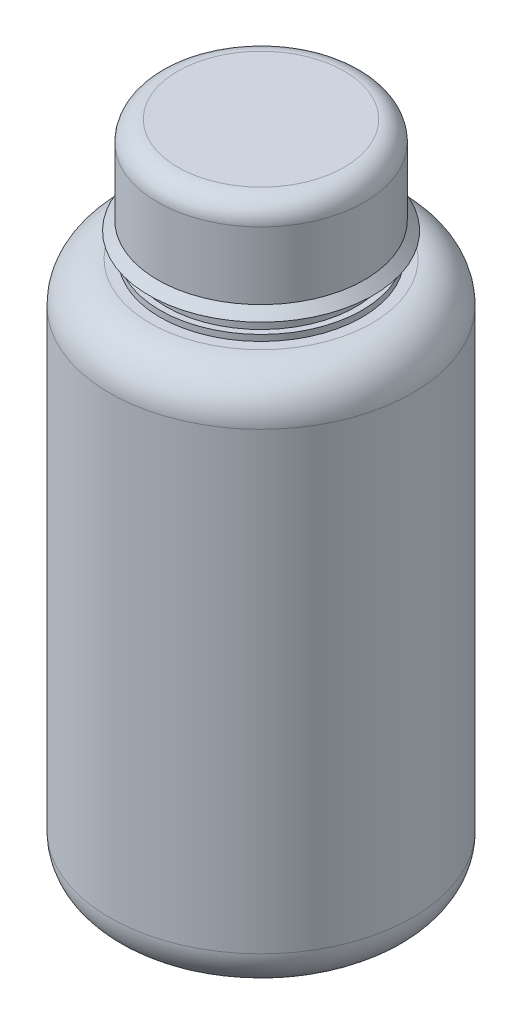
ISO-10303-21;
HEADER;
FILE_DESCRIPTION(('STEP AP214'),'2;1');
FILE_NAME('part.step','',(''),(''),'','','');
FILE_SCHEMA(('AUTOMOTIVE_DESIGN { 1 0 10303 214 1 1 1 1 }'));
ENDSEC;
DATA;
#1=APPLICATION_CONTEXT('core data for automotive mechanical design processes');
#2=APPLICATION_PROTOCOL_DEFINITION('international standard','automotive_design',2000,#1);
#3=PRODUCT_CONTEXT('',#1,'mechanical');
#4=PRODUCT('Part','Part','',(#3));
#5=PRODUCT_RELATED_PRODUCT_CATEGORY('part','',(#4));
#6=PRODUCT_DEFINITION_FORMATION('','',#4);
#7=PRODUCT_DEFINITION_CONTEXT('part definition',#1,'design');
#8=PRODUCT_DEFINITION('design','',#6,#7);
#9=PRODUCT_DEFINITION_SHAPE('','',#8);
#10=(LENGTH_UNIT() NAMED_UNIT(*) SI_UNIT(.MILLI.,.METRE.));
#11=(NAMED_UNIT(*) PLANE_ANGLE_UNIT() SI_UNIT($,.RADIAN.));
#12=(NAMED_UNIT(*) SI_UNIT($,.STERADIAN.) SOLID_ANGLE_UNIT());
#13=UNCERTAINTY_MEASURE_WITH_UNIT(LENGTH_MEASURE(1.E-05),#10,'distance_accuracy_value','');
#14=(GEOMETRIC_REPRESENTATION_CONTEXT(3) GLOBAL_UNCERTAINTY_ASSIGNED_CONTEXT((#13)) GLOBAL_UNIT_ASSIGNED_CONTEXT((#10,
#11,#12)) REPRESENTATION_CONTEXT('',''));
#15=CARTESIAN_POINT('',(0.,0.,0.));
#16=DIRECTION('',(0.,0.,1.));
#17=DIRECTION('',(1.,0.,0.));
#18=AXIS2_PLACEMENT_3D('',#15,#16,#17);
#19=CARTESIAN_POINT('',(0.,0.,0.));
#20=DIRECTION('',(0.,1.,0.));
#21=DIRECTION('',(0.,0.,1.));
#22=AXIS2_PLACEMENT_3D('',#19,#20,#21);
#23=PLANE('',#22);
#24=CARTESIAN_POINT('',(0.,0.,0.));
#25=DIRECTION('',(0.,-1.,0.));
#26=DIRECTION('',(0.,0.,-1.));
#27=AXIS2_PLACEMENT_3D('',#24,#25,#26);
#28=CIRCLE('',#27,34.9249999999999);
#29=CARTESIAN_POINT('',(0.,0.,-34.9249999999999));
#30=VERTEX_POINT('',#29);
#31=EDGE_CURVE('E10',#30,#30,#28,.T.);
#32=ORIENTED_EDGE('',*,*,#31,.T.);
#33=EDGE_LOOP('',(#32));
#34=FACE_BOUND('',#33,.T.);
#35=ADVANCED_FACE('F33',(#34),#23,.F.);
#36=CARTESIAN_POINT('',(0.,12.7,0.));
#37=DIRECTION('',(0.,-1.,0.));
#38=DIRECTION('',(0.,0.,-1.));
#39=AXIS2_PLACEMENT_3D('',#36,#37,#38);
#40=TOROIDAL_SURFACE('',#39,34.925,12.7);
#41=ORIENTED_EDGE('',*,*,#31,.F.);
#42=EDGE_LOOP('',(#41));
#43=FACE_BOUND('',#42,.T.);
#44=CARTESIAN_POINT('',(0.,12.7,0.));
#45=DIRECTION('',(0.,-1.,0.));
#46=DIRECTION('',(0.,0.,-1.));
#47=AXIS2_PLACEMENT_3D('',#44,#45,#46);
#48=CIRCLE('',#47,47.625);
#49=CARTESIAN_POINT('',(0.,12.7,-47.625));
#50=VERTEX_POINT('',#49);
#51=EDGE_CURVE('E39',#50,#50,#48,.T.);
#52=ORIENTED_EDGE('',*,*,#51,.T.);
#53=EDGE_LOOP('',(#52));
#54=FACE_BOUND('',#53,.T.);
#55=ADVANCED_FACE('F95',(#43,#54),#40,.T.);
#56=CARTESIAN_POINT('',(0.,-30.5346889952153,0.));
#57=DIRECTION('',(0.,-1.,0.));
#58=DIRECTION('',(0.,0.,-1.));
#59=AXIS2_PLACEMENT_3D('',#56,#57,#58);
#60=CYLINDRICAL_SURFACE('',#59,47.625);
#61=ORIENTED_EDGE('',*,*,#51,.F.);
#62=EDGE_LOOP('',(#61));
#63=FACE_BOUND('',#62,.T.);
#64=CARTESIAN_POINT('',(0.,155.575,0.));
#65=DIRECTION('',(0.,-1.,0.));
#66=DIRECTION('',(0.,0.,-1.));
#67=AXIS2_PLACEMENT_3D('',#64,#65,#66);
#68=CIRCLE('',#67,47.625);
#69=CARTESIAN_POINT('',(0.,155.575,-47.625));
#70=VERTEX_POINT('',#69);
#71=EDGE_CURVE('E43',#70,#70,#68,.T.);
#72=ORIENTED_EDGE('',*,*,#71,.T.);
#73=EDGE_LOOP('',(#72));
#74=FACE_BOUND('',#73,.T.);
#75=ADVANCED_FACE('F99',(#63,#74),#60,.T.);
#76=CARTESIAN_POINT('',(0.,155.575,0.));
#77=DIRECTION('',(0.,-1.,0.));
#78=DIRECTION('',(0.,0.,-1.));
#79=AXIS2_PLACEMENT_3D('',#76,#77,#78);
#80=TOROIDAL_SURFACE('',#79,34.925,12.7);
#81=ORIENTED_EDGE('',*,*,#71,.F.);
#82=EDGE_LOOP('',(#81));
#83=FACE_BOUND('',#82,.T.);
#84=CARTESIAN_POINT('',(0.,168.275,0.));
#85=DIRECTION('',(0.,-1.,0.));
#86=DIRECTION('',(0.,0.,-1.));
#87=AXIS2_PLACEMENT_3D('',#84,#85,#86);
#88=CIRCLE('',#87,34.925);
#89=CARTESIAN_POINT('',(0.,168.275,-34.925));
#90=VERTEX_POINT('',#89);
#91=EDGE_CURVE('E47',#90,#90,#88,.T.);
#92=ORIENTED_EDGE('',*,*,#91,.T.);
#93=EDGE_LOOP('',(#92));
#94=FACE_BOUND('',#93,.T.);
#95=ADVANCED_FACE('F104',(#83,#94),#80,.T.);
#96=CARTESIAN_POINT('',(0.,168.275,34.925));
#97=DIRECTION('',(0.,-1.,0.));
#98=DIRECTION('',(0.,0.,-1.));
#99=AXIS2_PLACEMENT_3D('',#96,#97,#98);
#100=PLANE('',#99);
#101=ORIENTED_EDGE('',*,*,#91,.F.);
#102=EDGE_LOOP('',(#101));
#103=FACE_BOUND('',#102,.T.);
#104=CARTESIAN_POINT('',(0.,168.275,0.));
#105=DIRECTION('',(0.,-1.,0.));
#106=DIRECTION('',(0.,0.,-1.));
#107=AXIS2_PLACEMENT_3D('',#104,#105,#106);
#108=CIRCLE('',#107,31.75);
#109=CARTESIAN_POINT('',(0.,168.275,-31.75));
#110=VERTEX_POINT('',#109);
#111=EDGE_CURVE('E52',#110,#110,#108,.T.);
#112=ORIENTED_EDGE('',*,*,#111,.T.);
#113=EDGE_LOOP('',(#112));
#114=FACE_BOUND('',#113,.T.);
#115=ADVANCED_FACE('F110',(#103,#114),#100,.F.);
#116=CARTESIAN_POINT('',(0.,-30.5346889952153,0.));
#117=DIRECTION('',(0.,-1.,0.));
#118=DIRECTION('',(0.,0.,-1.));
#119=AXIS2_PLACEMENT_3D('',#116,#117,#118);
#120=CYLINDRICAL_SURFACE('',#119,31.75);
#121=ORIENTED_EDGE('',*,*,#111,.F.);
#122=EDGE_LOOP('',(#121));
#123=FACE_BOUND('',#122,.T.);
#124=CARTESIAN_POINT('',(0.,170.188405715397,0.));
#125=DIRECTION('',(0.,-1.,0.));
#126=DIRECTION('',(0.,0.,-1.));
#127=AXIS2_PLACEMENT_3D('',#124,#125,#126);
#128=CIRCLE('',#127,31.75);
#129=CARTESIAN_POINT('',(0.,170.188405715397,-31.75));
#130=VERTEX_POINT('',#129);
#131=EDGE_CURVE('E55',#130,#130,#128,.T.);
#132=ORIENTED_EDGE('',*,*,#131,.T.);
#133=EDGE_LOOP('',(#132));
#134=FACE_BOUND('',#133,.T.);
#135=ADVANCED_FACE('F114',(#123,#134),#120,.T.);
#136=CARTESIAN_POINT('',(0.,170.188405715397,31.75));
#137=DIRECTION('',(0.,-1.,0.));
#138=DIRECTION('',(0.,0.,-1.));
#139=AXIS2_PLACEMENT_3D('',#136,#137,#138);
#140=PLANE('',#139);
#141=ORIENTED_EDGE('',*,*,#131,.F.);
#142=EDGE_LOOP('',(#141));
#143=FACE_BOUND('',#142,.T.);
#144=CARTESIAN_POINT('',(0.,170.188405715397,0.));
#145=DIRECTION('',(0.,-1.,0.));
#146=DIRECTION('',(0.,0.,-1.));
#147=AXIS2_PLACEMENT_3D('',#144,#145,#146);
#148=CIRCLE('',#147,29.8508319657065);
#149=CARTESIAN_POINT('',(0.,170.188405715397,-29.8508319657065));
#150=VERTEX_POINT('',#149);
#151=EDGE_CURVE('E58',#150,#150,#148,.T.);
#152=ORIENTED_EDGE('',*,*,#151,.T.);
#153=EDGE_LOOP('',(#152));
#154=FACE_BOUND('',#153,.T.);
#155=ADVANCED_FACE('F118',(#143,#154),#140,.F.);
#156=CARTESIAN_POINT('',(0.,-30.5346889952153,0.));
#157=DIRECTION('',(0.,-1.,0.));
#158=DIRECTION('',(0.,0.,-1.));
#159=AXIS2_PLACEMENT_3D('',#156,#157,#158);
#160=CYLINDRICAL_SURFACE('',#159,29.8508319657065);
#161=ORIENTED_EDGE('',*,*,#151,.F.);
#162=EDGE_LOOP('',(#161));
#163=FACE_BOUND('',#162,.T.);
#164=CARTESIAN_POINT('',(0.,174.113488188644,0.));
#165=DIRECTION('',(0.,-1.,0.));
#166=DIRECTION('',(0.,0.,-1.));
#167=AXIS2_PLACEMENT_3D('',#164,#165,#166);
#168=CIRCLE('',#167,29.8508319657065);
#169=CARTESIAN_POINT('',(0.,174.113488188644,-29.8508319657065));
#170=VERTEX_POINT('',#169);
#171=EDGE_CURVE('E61',#170,#170,#168,.T.);
#172=ORIENTED_EDGE('',*,*,#171,.T.);
#173=EDGE_LOOP('',(#172));
#174=FACE_BOUND('',#173,.T.);
#175=ADVANCED_FACE('F122',(#163,#174),#160,.T.);
#176=CARTESIAN_POINT('',(0.,174.113488188644,29.8508319657065));
#177=DIRECTION('',(0.,1.,0.));
#178=DIRECTION('',(0.,0.,1.));
#179=AXIS2_PLACEMENT_3D('',#176,#177,#178);
#180=PLANE('',#179);
#181=ORIENTED_EDGE('',*,*,#171,.F.);
#182=EDGE_LOOP('',(#181));
#183=FACE_BOUND('',#182,.T.);
#184=CARTESIAN_POINT('',(0.,174.113488188644,0.));
#185=DIRECTION('',(0.,-1.,0.));
#186=DIRECTION('',(0.,0.,-1.));
#187=AXIS2_PLACEMENT_3D('',#184,#185,#186);
#188=CIRCLE('',#187,31.75);
#189=CARTESIAN_POINT('',(0.,174.113488188644,-31.75));
#190=VERTEX_POINT('',#189);
#191=EDGE_CURVE('E64',#190,#190,#188,.T.);
#192=ORIENTED_EDGE('',*,*,#191,.T.);
#193=EDGE_LOOP('',(#192));
#194=FACE_BOUND('',#193,.T.);
#195=ADVANCED_FACE('F126',(#183,#194),#180,.F.);
#196=CARTESIAN_POINT('',(0.,-30.5346889952153,0.));
#197=DIRECTION('',(0.,-1.,0.));
#198=DIRECTION('',(0.,0.,-1.));
#199=AXIS2_PLACEMENT_3D('',#196,#197,#198);
#200=CYLINDRICAL_SURFACE('',#199,31.75);
#201=ORIENTED_EDGE('',*,*,#191,.F.);
#202=EDGE_LOOP('',(#201));
#203=FACE_BOUND('',#202,.T.);
#204=CARTESIAN_POINT('',(0.,176.015383726842,0.));
#205=DIRECTION('',(0.,-1.,0.));
#206=DIRECTION('',(0.,0.,-1.));
#207=AXIS2_PLACEMENT_3D('',#204,#205,#206);
#208=CIRCLE('',#207,31.75);
#209=CARTESIAN_POINT('',(0.,176.015383726842,-31.75));
#210=VERTEX_POINT('',#209);
#211=EDGE_CURVE('E67',#210,#210,#208,.T.);
#212=ORIENTED_EDGE('',*,*,#211,.T.);
#213=EDGE_LOOP('',(#212));
#214=FACE_BOUND('',#213,.T.);
#215=ADVANCED_FACE('F130',(#203,#214),#200,.T.);
#216=CARTESIAN_POINT('',(0.,176.015383726842,31.75));
#217=DIRECTION('',(0.,1.,0.));
#218=DIRECTION('',(0.,0.,1.));
#219=AXIS2_PLACEMENT_3D('',#216,#217,#218);
#220=PLANE('',#219);
#221=ORIENTED_EDGE('',*,*,#211,.F.);
#222=EDGE_LOOP('',(#221));
#223=FACE_BOUND('',#222,.T.);
#224=CARTESIAN_POINT('',(0.,176.015383726842,0.));
#225=DIRECTION('',(0.,-1.,0.));
#226=DIRECTION('',(0.,0.,-1.));
#227=AXIS2_PLACEMENT_3D('',#224,#225,#226);
#228=CIRCLE('',#227,35.2590862363304);
#229=CARTESIAN_POINT('',(0.,176.015383726842,-35.2590862363304));
#230=VERTEX_POINT('',#229);
#231=EDGE_CURVE('E70',#230,#230,#228,.T.);
#232=ORIENTED_EDGE('',*,*,#231,.T.);
#233=EDGE_LOOP('',(#232));
#234=FACE_BOUND('',#233,.T.);
#235=ADVANCED_FACE('F134',(#223,#234),#220,.F.);
#236=CARTESIAN_POINT('',(0.,178.870311850021,0.));
#237=DIRECTION('',(0.,-1.,0.));
#238=DIRECTION('',(0.,0.,-1.));
#239=AXIS2_PLACEMENT_3D('',#236,#237,#238);
#240=CONICAL_SURFACE('',#239,32.54375,0.760343216809692);
#241=ORIENTED_EDGE('',*,*,#231,.F.);
#242=EDGE_LOOP('',(#241));
#243=FACE_BOUND('',#242,.T.);
#244=CARTESIAN_POINT('',(0.,178.870311850021,0.));
#245=DIRECTION('',(0.,-1.,0.));
#246=DIRECTION('',(0.,0.,-1.));
#247=AXIS2_PLACEMENT_3D('',#244,#245,#246);
#248=CIRCLE('',#247,32.54375);
#249=CARTESIAN_POINT('',(0.,178.870311850021,-32.54375));
#250=VERTEX_POINT('',#249);
#251=EDGE_CURVE('E73',#250,#250,#248,.T.);
#252=ORIENTED_EDGE('',*,*,#251,.T.);
#253=EDGE_LOOP('',(#252));
#254=FACE_BOUND('',#253,.T.);
#255=ADVANCED_FACE('F138',(#243,#254),#240,.T.);
#256=CARTESIAN_POINT('',(0.,-30.5346889952153,0.));
#257=DIRECTION('',(0.,-1.,0.));
#258=DIRECTION('',(0.,0.,-1.));
#259=AXIS2_PLACEMENT_3D('',#256,#257,#258);
#260=CYLINDRICAL_SURFACE('',#259,32.54375);
#261=ORIENTED_EDGE('',*,*,#251,.F.);
#262=EDGE_LOOP('',(#261));
#263=FACE_BOUND('',#262,.T.);
#264=CARTESIAN_POINT('',(0.,200.025,0.));
#265=DIRECTION('',(0.,-1.,0.));
#266=DIRECTION('',(0.,0.,-1.));
#267=AXIS2_PLACEMENT_3D('',#264,#265,#266);
#268=CIRCLE('',#267,32.54375);
#269=CARTESIAN_POINT('',(0.,200.025,-32.54375));
#270=VERTEX_POINT('',#269);
#271=EDGE_CURVE('E76',#270,#270,#268,.T.);
#272=ORIENTED_EDGE('',*,*,#271,.T.);
#273=EDGE_LOOP('',(#272));
#274=FACE_BOUND('',#273,.T.);
#275=ADVANCED_FACE('F91',(#263,#274),#260,.T.);
#276=CARTESIAN_POINT('',(0.,200.025,0.));
#277=DIRECTION('',(0.,-1.,0.));
#278=DIRECTION('',(0.,0.,-1.));
#279=AXIS2_PLACEMENT_3D('',#276,#277,#278);
#280=TOROIDAL_SURFACE('',#279,26.19375,6.35);
#281=ORIENTED_EDGE('',*,*,#271,.F.);
#282=EDGE_LOOP('',(#281));
#283=FACE_BOUND('',#282,.T.);
#284=CARTESIAN_POINT('',(0.,206.375,0.));
#285=DIRECTION('',(0.,-1.,0.));
#286=DIRECTION('',(0.,0.,-1.));
#287=AXIS2_PLACEMENT_3D('',#284,#285,#286);
#288=CIRCLE('',#287,26.19375);
#289=CARTESIAN_POINT('',(0.,206.375,-26.19375));
#290=VERTEX_POINT('',#289);
#291=EDGE_CURVE('E79',#290,#290,#288,.T.);
#292=ORIENTED_EDGE('',*,*,#291,.T.);
#293=EDGE_LOOP('',(#292));
#294=FACE_BOUND('',#293,.T.);
#295=ADVANCED_FACE('F83',(#283,#294),#280,.T.);
#296=CARTESIAN_POINT('',(0.,206.375,26.19375));
#297=DIRECTION('',(0.,-1.,0.));
#298=DIRECTION('',(0.,0.,-1.));
#299=AXIS2_PLACEMENT_3D('',#296,#297,#298);
#300=PLANE('',#299);
#301=ORIENTED_EDGE('',*,*,#291,.F.);
#302=EDGE_LOOP('',(#301));
#303=FACE_BOUND('',#302,.T.);
#304=ADVANCED_FACE('F85',(#303),#300,.F.);
#305=CLOSED_SHELL('',(#35,#55,#75,#95,#115,#135,#155,#175,#195,#215,#235,#255,#275,#295,#304));
#306=MANIFOLD_SOLID_BREP('B2',#305);
#307=ADVANCED_BREP_SHAPE_REPRESENTATION('',(#18,#306),#14);
#308=SHAPE_DEFINITION_REPRESENTATION(#9,#307);
ENDSEC;
END-ISO-10303-21;
